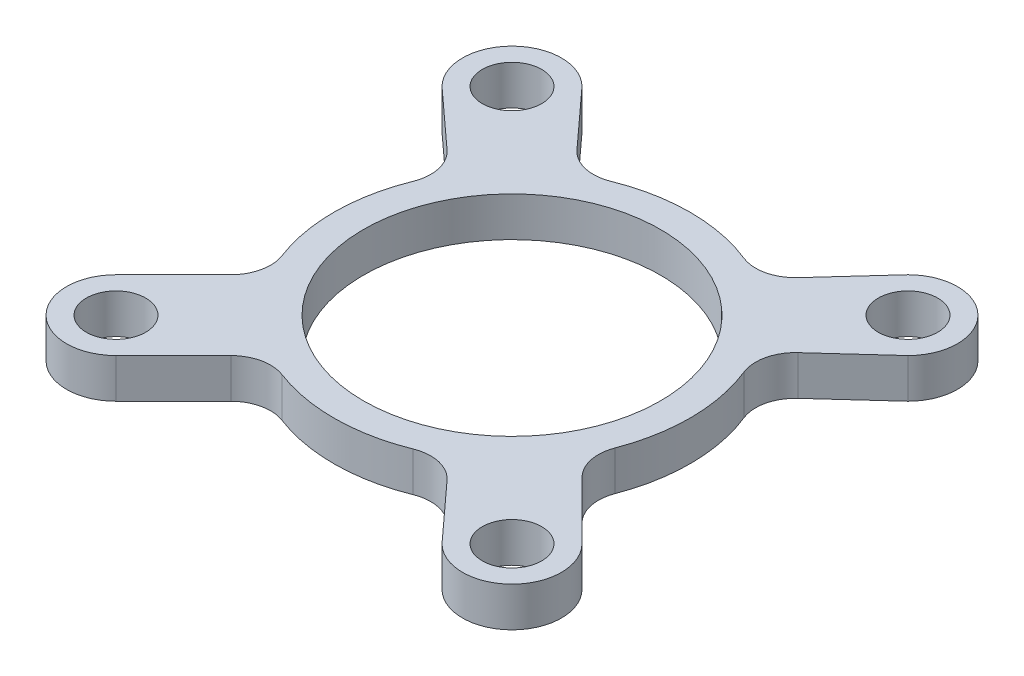
ISO-10303-21;
HEADER;
FILE_DESCRIPTION(('STEP AP214'),'2;1');
FILE_NAME('part.step','',(''),(''),'','','');
FILE_SCHEMA(('AUTOMOTIVE_DESIGN { 1 0 10303 214 1 1 1 1 }'));
ENDSEC;
DATA;
#1=APPLICATION_CONTEXT('core data for automotive mechanical design processes');
#2=APPLICATION_PROTOCOL_DEFINITION('international standard','automotive_design',2000,#1);
#3=PRODUCT_CONTEXT('',#1,'mechanical');
#4=PRODUCT('Part','Part','',(#3));
#5=PRODUCT_RELATED_PRODUCT_CATEGORY('part','',(#4));
#6=PRODUCT_DEFINITION_FORMATION('','',#4);
#7=PRODUCT_DEFINITION_CONTEXT('part definition',#1,'design');
#8=PRODUCT_DEFINITION('design','',#6,#7);
#9=PRODUCT_DEFINITION_SHAPE('','',#8);
#10=(LENGTH_UNIT() NAMED_UNIT(*) SI_UNIT(.MILLI.,.METRE.));
#11=(NAMED_UNIT(*) PLANE_ANGLE_UNIT() SI_UNIT($,.RADIAN.));
#12=(NAMED_UNIT(*) SI_UNIT($,.STERADIAN.) SOLID_ANGLE_UNIT());
#13=UNCERTAINTY_MEASURE_WITH_UNIT(LENGTH_MEASURE(1.E-05),#10,'distance_accuracy_value','');
#14=(GEOMETRIC_REPRESENTATION_CONTEXT(3) GLOBAL_UNCERTAINTY_ASSIGNED_CONTEXT((#13)) GLOBAL_UNIT_ASSIGNED_CONTEXT((#10,
#11,#12)) REPRESENTATION_CONTEXT('',''));
#15=CARTESIAN_POINT('',(0.,0.,0.));
#16=DIRECTION('',(0.,0.,1.));
#17=DIRECTION('',(1.,0.,0.));
#18=AXIS2_PLACEMENT_3D('',#15,#16,#17);
#19=CARTESIAN_POINT('',(-10.0000000000001,2.,10.));
#20=DIRECTION('',(0.,1.,0.));
#21=DIRECTION('',(0.,0.,1.));
#22=AXIS2_PLACEMENT_3D('',#19,#20,#21);
#23=PLANE('',#22);
#24=CARTESIAN_POINT('',(10.0000000000001,2.,-10.));
#25=DIRECTION('',(0.,1.,0.));
#26=DIRECTION('',(0.,0.,1.));
#27=AXIS2_PLACEMENT_3D('',#24,#25,#26);
#28=CIRCLE('',#27,1.5);
#29=CARTESIAN_POINT('',(10.0000000000001,2.,-8.5));
#30=VERTEX_POINT('',#29);
#31=EDGE_CURVE('E706',#30,#30,#28,.T.);
#32=ORIENTED_EDGE('',*,*,#31,.F.);
#33=EDGE_LOOP('',(#32));
#34=FACE_BOUND('',#33,.T.);
#35=CARTESIAN_POINT('',(-10.0000000000001,2.,10.));
#36=DIRECTION('',(0.,1.,0.));
#37=DIRECTION('',(0.,0.,1.));
#38=AXIS2_PLACEMENT_3D('',#35,#36,#37);
#39=CIRCLE('',#38,1.5);
#40=CARTESIAN_POINT('',(-10.0000000000001,2.,11.5));
#41=VERTEX_POINT('',#40);
#42=EDGE_CURVE('E694',#41,#41,#39,.T.);
#43=ORIENTED_EDGE('',*,*,#42,.F.);
#44=EDGE_LOOP('',(#43));
#45=FACE_BOUND('',#44,.T.);
#46=CARTESIAN_POINT('',(-10.0000000000001,2.,10.));
#47=DIRECTION('',(0.,1.,0.));
#48=DIRECTION('',(0.,0.,1.));
#49=AXIS2_PLACEMENT_3D('',#46,#47,#48);
#50=CIRCLE('',#49,2.50000000000001);
#51=CARTESIAN_POINT('',(-11.7677669529665,2.,8.23223304703362));
#52=VERTEX_POINT('',#51);
#53=CARTESIAN_POINT('',(-8.23223304703374,2.,11.7677669529664));
#54=VERTEX_POINT('',#53);
#55=EDGE_CURVE('E216',#52,#54,#50,.T.);
#56=ORIENTED_EDGE('',*,*,#55,.T.);
#57=DIRECTION('',(0.707106781186549,0.,-0.707106781186546));
#58=VECTOR('',#57,1.);
#59=CARTESIAN_POINT('',(-8.23223304703374,2.,11.7677669529664));
#60=LINE('',#59,#58);
#61=CARTESIAN_POINT('',(-5.32976783032287,2.,8.86530173625554));
#62=VERTEX_POINT('',#61);
#63=EDGE_CURVE('E205',#54,#62,#60,.T.);
#64=ORIENTED_EDGE('',*,*,#63,.T.);
#65=CARTESIAN_POINT('',(-3.91555426794978,2.,10.2795152986286));
#66=DIRECTION('',(0.,1.,0.));
#67=DIRECTION('',(0.,0.,1.));
#68=AXIS2_PLACEMENT_3D('',#65,#66,#67);
#69=CIRCLE('',#68,2.);
#70=CARTESIAN_POINT('',(-3.20363531014073,2.,8.41051251705979));
#71=VERTEX_POINT('',#70);
#72=EDGE_CURVE('E289',#62,#71,#69,.F.);
#73=ORIENTED_EDGE('',*,*,#72,.T.);
#74=CARTESIAN_POINT('',(0.,2.,0.));
#75=DIRECTION('',(0.,1.,0.));
#76=DIRECTION('',(0.,0.,1.));
#77=AXIS2_PLACEMENT_3D('',#74,#75,#76);
#78=CIRCLE('',#77,9.);
#79=CARTESIAN_POINT('',(3.35602438202188,2.,8.3508742265271));
#80=VERTEX_POINT('',#79);
#81=EDGE_CURVE('E215',#71,#80,#78,.T.);
#82=ORIENTED_EDGE('',*,*,#81,.T.);
#83=CARTESIAN_POINT('',(4.10180757802675,2.,10.2066240546442));
#84=DIRECTION('',(0.,1.,0.));
#85=DIRECTION('',(0.,0.,1.));
#86=AXIS2_PLACEMENT_3D('',#83,#84,#85);
#87=CIRCLE('',#86,2.);
#88=CARTESIAN_POINT('',(5.57959055754192,2.,8.85897518885788));
#89=VERTEX_POINT('',#88);
#90=EDGE_CURVE('E285',#80,#89,#87,.F.);
#91=ORIENTED_EDGE('',*,*,#90,.T.);
#92=DIRECTION('',(0.673824432893175,0.,0.73889148975759));
#93=VECTOR('',#92,1.);
#94=CARTESIAN_POINT('',(8.23223304703362,2.,11.7677669529665));
#95=LINE('',#94,#93);
#96=CARTESIAN_POINT('',(8.23223304703362,2.,11.7677669529665));
#97=VERTEX_POINT('',#96);
#98=EDGE_CURVE('E684',#89,#97,#95,.T.);
#99=ORIENTED_EDGE('',*,*,#98,.T.);
#100=CARTESIAN_POINT('',(10.,2.,10.0000000000001));
#101=DIRECTION('',(0.,1.,0.));
#102=DIRECTION('',(0.,0.,1.));
#103=AXIS2_PLACEMENT_3D('',#100,#101,#102);
#104=CIRCLE('',#103,2.5);
#105=CARTESIAN_POINT('',(11.7677669529664,2.,8.23223304703374));
#106=VERTEX_POINT('',#105);
#107=EDGE_CURVE('E412',#97,#106,#104,.T.);
#108=ORIENTED_EDGE('',*,*,#107,.T.);
#109=DIRECTION('',(-0.707106781186542,0.,-0.707106781186553));
#110=VECTOR('',#109,1.);
#111=CARTESIAN_POINT('',(11.7677669529664,2.,8.23223304703374));
#112=LINE('',#111,#110);
#113=CARTESIAN_POINT('',(8.86530173625554,2.,5.32976783032286));
#114=VERTEX_POINT('',#113);
#115=EDGE_CURVE('E391',#106,#114,#112,.T.);
#116=ORIENTED_EDGE('',*,*,#115,.T.);
#117=CARTESIAN_POINT('',(10.2795152986286,2.,3.91555426794978));
#118=DIRECTION('',(0.,1.,0.));
#119=DIRECTION('',(0.,0.,1.));
#120=AXIS2_PLACEMENT_3D('',#117,#118,#119);
#121=CIRCLE('',#120,2.);
#122=CARTESIAN_POINT('',(8.4105125170598,2.,3.20363531014073));
#123=VERTEX_POINT('',#122);
#124=EDGE_CURVE('E277',#114,#123,#121,.F.);
#125=ORIENTED_EDGE('',*,*,#124,.T.);
#126=CARTESIAN_POINT('',(0.,2.,0.));
#127=DIRECTION('',(0.,1.,0.));
#128=DIRECTION('',(0.,0.,1.));
#129=AXIS2_PLACEMENT_3D('',#126,#127,#128);
#130=CIRCLE('',#129,9.);
#131=CARTESIAN_POINT('',(8.3508742265271,2.,-3.35602438202188));
#132=VERTEX_POINT('',#131);
#133=EDGE_CURVE('E406',#123,#132,#130,.T.);
#134=ORIENTED_EDGE('',*,*,#133,.T.);
#135=CARTESIAN_POINT('',(10.2066240546442,2.,-4.10180757802675));
#136=DIRECTION('',(0.,1.,0.));
#137=DIRECTION('',(0.,0.,1.));
#138=AXIS2_PLACEMENT_3D('',#135,#136,#137);
#139=CIRCLE('',#138,2.);
#140=CARTESIAN_POINT('',(8.85897518885789,2.,-5.57959055754193));
#141=VERTEX_POINT('',#140);
#142=EDGE_CURVE('E281',#132,#141,#139,.F.);
#143=ORIENTED_EDGE('',*,*,#142,.T.);
#144=DIRECTION('',(0.738891489757591,0.,-0.673824432893175));
#145=VECTOR('',#144,1.);
#146=CARTESIAN_POINT('',(11.7677669529665,2.,-8.23223304703362));
#147=LINE('',#146,#145);
#148=CARTESIAN_POINT('',(11.7677669529665,2.,-8.23223304703363));
#149=VERTEX_POINT('',#148);
#150=EDGE_CURVE('E408',#141,#149,#147,.T.);
#151=ORIENTED_EDGE('',*,*,#150,.T.);
#152=CARTESIAN_POINT('',(10.0000000000001,2.,-10.));
#153=DIRECTION('',(0.,1.,0.));
#154=DIRECTION('',(0.,0.,-1.));
#155=AXIS2_PLACEMENT_3D('',#152,#153,#154);
#156=CIRCLE('',#155,2.5);
#157=CARTESIAN_POINT('',(8.23223304703374,2.,-11.7677669529664));
#158=VERTEX_POINT('',#157);
#159=EDGE_CURVE('E410',#149,#158,#156,.T.);
#160=ORIENTED_EDGE('',*,*,#159,.T.);
#161=DIRECTION('',(-0.673824432893177,0.,0.738891489757589));
#162=VECTOR('',#161,1.);
#163=CARTESIAN_POINT('',(8.23223304703374,2.,-11.7677669529664));
#164=LINE('',#163,#162);
#165=CARTESIAN_POINT('',(5.57959055754206,2.,-8.85897518885783));
#166=VERTEX_POINT('',#165);
#167=EDGE_CURVE('E329',#158,#166,#164,.T.);
#168=ORIENTED_EDGE('',*,*,#167,.T.);
#169=CARTESIAN_POINT('',(4.10180757802688,2.,-10.2066240546442));
#170=DIRECTION('',(0.,1.,0.));
#171=DIRECTION('',(0.,0.,1.));
#172=AXIS2_PLACEMENT_3D('',#169,#170,#171);
#173=CIRCLE('',#172,2.);
#174=CARTESIAN_POINT('',(3.35602438202199,2.,-8.35087422652706));
#175=VERTEX_POINT('',#174);
#176=EDGE_CURVE('E301',#166,#175,#173,.F.);
#177=ORIENTED_EDGE('',*,*,#176,.T.);
#178=CARTESIAN_POINT('',(0.,2.,0.));
#179=DIRECTION('',(0.,1.,0.));
#180=DIRECTION('',(0.,0.,1.));
#181=AXIS2_PLACEMENT_3D('',#178,#179,#180);
#182=CIRCLE('',#181,9.);
#183=CARTESIAN_POINT('',(-3.3560243820219,2.,-8.35087422652709));
#184=VERTEX_POINT('',#183);
#185=EDGE_CURVE('E325',#175,#184,#182,.T.);
#186=ORIENTED_EDGE('',*,*,#185,.T.);
#187=CARTESIAN_POINT('',(-4.10180757802676,2.,-10.2066240546442));
#188=DIRECTION('',(0.,1.,0.));
#189=DIRECTION('',(0.,0.,1.));
#190=AXIS2_PLACEMENT_3D('',#187,#188,#189);
#191=CIRCLE('',#190,2.);
#192=CARTESIAN_POINT('',(-5.57959055754195,2.,-8.85897518885788));
#193=VERTEX_POINT('',#192);
#194=EDGE_CURVE('E13',#184,#193,#191,.F.);
#195=ORIENTED_EDGE('',*,*,#194,.T.);
#196=DIRECTION('',(-0.673824432893173,0.,-0.738891489757592));
#197=VECTOR('',#196,1.);
#198=CARTESIAN_POINT('',(-8.23223304703363,2.,-11.7677669529665));
#199=LINE('',#198,#197);
#200=CARTESIAN_POINT('',(-8.23223304703362,2.,-11.7677669529665));
#201=VERTEX_POINT('',#200);
#202=EDGE_CURVE('E321',#193,#201,#199,.T.);
#203=ORIENTED_EDGE('',*,*,#202,.T.);
#204=CARTESIAN_POINT('',(-10.,2.,-10.0000000000001));
#205=DIRECTION('',(0.,1.,0.));
#206=DIRECTION('',(0.,0.,-1.));
#207=AXIS2_PLACEMENT_3D('',#204,#205,#206);
#208=CIRCLE('',#207,2.5);
#209=CARTESIAN_POINT('',(-11.7677669529664,2.,-8.23223304703374));
#210=VERTEX_POINT('',#209);
#211=EDGE_CURVE('E324',#201,#210,#208,.T.);
#212=ORIENTED_EDGE('',*,*,#211,.T.);
#213=DIRECTION('',(0.738891489757588,0.,0.673824432893177));
#214=VECTOR('',#213,1.);
#215=CARTESIAN_POINT('',(-11.7677669529664,2.,-8.23223304703374));
#216=LINE('',#215,#214);
#217=CARTESIAN_POINT('',(-8.85897518885783,2.,-5.57959055754206));
#218=VERTEX_POINT('',#217);
#219=EDGE_CURVE('E327',#210,#218,#216,.T.);
#220=ORIENTED_EDGE('',*,*,#219,.T.);
#221=CARTESIAN_POINT('',(-10.2066240546442,2.,-4.10180757802688));
#222=DIRECTION('',(0.,1.,0.));
#223=DIRECTION('',(0.,0.,1.));
#224=AXIS2_PLACEMENT_3D('',#221,#222,#223);
#225=CIRCLE('',#224,2.);
#226=CARTESIAN_POINT('',(-8.35087422652706,2.,-3.35602438202199));
#227=VERTEX_POINT('',#226);
#228=EDGE_CURVE('E297',#218,#227,#225,.F.);
#229=ORIENTED_EDGE('',*,*,#228,.T.);
#230=CARTESIAN_POINT('',(0.,2.,0.));
#231=DIRECTION('',(0.,1.,0.));
#232=DIRECTION('',(0.,0.,1.));
#233=AXIS2_PLACEMENT_3D('',#230,#231,#232);
#234=CIRCLE('',#233,9.);
#235=CARTESIAN_POINT('',(-8.41051251705983,2.,3.20363531014064));
#236=VERTEX_POINT('',#235);
#237=EDGE_CURVE('E335',#227,#236,#234,.T.);
#238=ORIENTED_EDGE('',*,*,#237,.T.);
#239=CARTESIAN_POINT('',(-10.2795152986287,2.,3.91555426794968));
#240=DIRECTION('',(0.,1.,0.));
#241=DIRECTION('',(0.,0.,1.));
#242=AXIS2_PLACEMENT_3D('',#239,#240,#241);
#243=CIRCLE('',#242,2.);
#244=CARTESIAN_POINT('',(-8.86530173625559,2.,5.32976783032278));
#245=VERTEX_POINT('',#244);
#246=EDGE_CURVE('E293',#236,#245,#243,.F.);
#247=ORIENTED_EDGE('',*,*,#246,.T.);
#248=DIRECTION('',(-0.707106781186551,0.,0.707106781186544));
#249=VECTOR('',#248,1.);
#250=CARTESIAN_POINT('',(-11.7677669529665,2.,8.23223304703362));
#251=LINE('',#250,#249);
#252=EDGE_CURVE('E221',#245,#52,#251,.T.);
#253=ORIENTED_EDGE('',*,*,#252,.T.);
#254=EDGE_LOOP('',(#56,#64,#73,#82,#91,#99,#108,#116,#125,#134,#143,#151,#160,#168,#177,#186,
#195,#203,#212,#220,#229,#238,#247,#253));
#255=FACE_BOUND('',#254,.T.);
#256=CARTESIAN_POINT('',(0.,2.,0.));
#257=DIRECTION('',(0.,1.,0.));
#258=DIRECTION('',(0.,0.,1.));
#259=AXIS2_PLACEMENT_3D('',#256,#257,#258);
#260=CIRCLE('',#259,7.5);
#261=CARTESIAN_POINT('',(0.,2.,7.5));
#262=VERTEX_POINT('',#261);
#263=EDGE_CURVE('E342',#262,#262,#260,.T.);
#264=ORIENTED_EDGE('',*,*,#263,.F.);
#265=EDGE_LOOP('',(#264));
#266=FACE_BOUND('',#265,.T.);
#267=CARTESIAN_POINT('',(10.,2.,10.0000000000001));
#268=DIRECTION('',(0.,1.,0.));
#269=DIRECTION('',(0.,0.,1.));
#270=AXIS2_PLACEMENT_3D('',#267,#268,#269);
#271=CIRCLE('',#270,1.5);
#272=CARTESIAN_POINT('',(10.,2.,11.5000000000001));
#273=VERTEX_POINT('',#272);
#274=EDGE_CURVE('E700',#273,#273,#271,.T.);
#275=ORIENTED_EDGE('',*,*,#274,.F.);
#276=EDGE_LOOP('',(#275));
#277=FACE_BOUND('',#276,.T.);
#278=CARTESIAN_POINT('',(-10.,2.,-10.0000000000001));
#279=DIRECTION('',(0.,1.,0.));
#280=DIRECTION('',(0.,0.,1.));
#281=AXIS2_PLACEMENT_3D('',#278,#279,#280);
#282=CIRCLE('',#281,1.5);
#283=CARTESIAN_POINT('',(-10.,2.,-8.5000000000001));
#284=VERTEX_POINT('',#283);
#285=EDGE_CURVE('E712',#284,#284,#282,.T.);
#286=ORIENTED_EDGE('',*,*,#285,.F.);
#287=EDGE_LOOP('',(#286));
#288=FACE_BOUND('',#287,.T.);
#289=ADVANCED_FACE('F45',(#34,#45,#255,#266,#277,#288),#23,.T.);
#290=CARTESIAN_POINT('',(-10.0000000000001,0.,10.));
#291=DIRECTION('',(0.,1.,0.));
#292=DIRECTION('',(0.,0.,1.));
#293=AXIS2_PLACEMENT_3D('',#290,#291,#292);
#294=PLANE('',#293);
#295=CARTESIAN_POINT('',(-10.0000000000001,0.,10.));
#296=DIRECTION('',(0.,1.,0.));
#297=DIRECTION('',(0.,0.,1.));
#298=AXIS2_PLACEMENT_3D('',#295,#296,#297);
#299=CIRCLE('',#298,2.50000000000001);
#300=CARTESIAN_POINT('',(-11.7677669529665,0.,8.23223304703362));
#301=VERTEX_POINT('',#300);
#302=CARTESIAN_POINT('',(-8.23223304703374,0.,11.7677669529664));
#303=VERTEX_POINT('',#302);
#304=EDGE_CURVE('E229',#301,#303,#299,.T.);
#305=ORIENTED_EDGE('',*,*,#304,.F.);
#306=DIRECTION('',(-0.707106781186551,0.,0.707106781186544));
#307=VECTOR('',#306,1.);
#308=CARTESIAN_POINT('',(-11.7677669529665,0.,8.23223304703362));
#309=LINE('',#308,#307);
#310=CARTESIAN_POINT('',(-8.86530173625559,0.,5.32976783032278));
#311=VERTEX_POINT('',#310);
#312=EDGE_CURVE('E225',#311,#301,#309,.T.);
#313=ORIENTED_EDGE('',*,*,#312,.F.);
#314=CARTESIAN_POINT('',(-10.2795152986287,0.,3.91555426794968));
#315=DIRECTION('',(0.,1.,0.));
#316=DIRECTION('',(0.,0.,1.));
#317=AXIS2_PLACEMENT_3D('',#314,#315,#316);
#318=CIRCLE('',#317,2.);
#319=CARTESIAN_POINT('',(-8.41051251705983,0.,3.20363531014064));
#320=VERTEX_POINT('',#319);
#321=EDGE_CURVE('E291',#311,#320,#318,.T.);
#322=ORIENTED_EDGE('',*,*,#321,.T.);
#323=CARTESIAN_POINT('',(0.,0.,0.));
#324=DIRECTION('',(0.,1.,0.));
#325=DIRECTION('',(0.,0.,1.));
#326=AXIS2_PLACEMENT_3D('',#323,#324,#325);
#327=CIRCLE('',#326,9.);
#328=CARTESIAN_POINT('',(-8.35087422652706,0.,-3.35602438202199));
#329=VERTEX_POINT('',#328);
#330=EDGE_CURVE('E369',#329,#320,#327,.T.);
#331=ORIENTED_EDGE('',*,*,#330,.F.);
#332=CARTESIAN_POINT('',(-10.2066240546442,0.,-4.10180757802688));
#333=DIRECTION('',(0.,1.,0.));
#334=DIRECTION('',(0.,0.,1.));
#335=AXIS2_PLACEMENT_3D('',#332,#333,#334);
#336=CIRCLE('',#335,2.);
#337=CARTESIAN_POINT('',(-8.85897518885783,0.,-5.57959055754206));
#338=VERTEX_POINT('',#337);
#339=EDGE_CURVE('E295',#329,#338,#336,.T.);
#340=ORIENTED_EDGE('',*,*,#339,.T.);
#341=DIRECTION('',(0.738891489757588,0.,0.673824432893177));
#342=VECTOR('',#341,1.);
#343=CARTESIAN_POINT('',(-11.7677669529664,0.,-8.23223304703374));
#344=LINE('',#343,#342);
#345=CARTESIAN_POINT('',(-11.7677669529664,0.,-8.23223304703374));
#346=VERTEX_POINT('',#345);
#347=EDGE_CURVE('E366',#346,#338,#344,.T.);
#348=ORIENTED_EDGE('',*,*,#347,.F.);
#349=CARTESIAN_POINT('',(-10.,0.,-10.0000000000001));
#350=DIRECTION('',(0.,1.,0.));
#351=DIRECTION('',(0.,0.,-1.));
#352=AXIS2_PLACEMENT_3D('',#349,#350,#351);
#353=CIRCLE('',#352,2.5);
#354=CARTESIAN_POINT('',(-8.23223304703362,0.,-11.7677669529665));
#355=VERTEX_POINT('',#354);
#356=EDGE_CURVE('E364',#355,#346,#353,.T.);
#357=ORIENTED_EDGE('',*,*,#356,.F.);
#358=DIRECTION('',(-0.673824432893173,0.,-0.738891489757592));
#359=VECTOR('',#358,1.);
#360=CARTESIAN_POINT('',(-8.23223304703363,0.,-11.7677669529665));
#361=LINE('',#360,#359);
#362=CARTESIAN_POINT('',(-5.57959055754195,0.,-8.85897518885788));
#363=VERTEX_POINT('',#362);
#364=EDGE_CURVE('E310',#363,#355,#361,.T.);
#365=ORIENTED_EDGE('',*,*,#364,.F.);
#366=CARTESIAN_POINT('',(-4.10180757802676,0.,-10.2066240546442));
#367=DIRECTION('',(0.,1.,0.));
#368=DIRECTION('',(0.,0.,1.));
#369=AXIS2_PLACEMENT_3D('',#366,#367,#368);
#370=CIRCLE('',#369,2.);
#371=CARTESIAN_POINT('',(-3.3560243820219,0.,-8.35087422652709));
#372=VERTEX_POINT('',#371);
#373=EDGE_CURVE('E53',#363,#372,#370,.T.);
#374=ORIENTED_EDGE('',*,*,#373,.T.);
#375=CARTESIAN_POINT('',(0.,0.,0.));
#376=DIRECTION('',(0.,1.,0.));
#377=DIRECTION('',(0.,0.,1.));
#378=AXIS2_PLACEMENT_3D('',#375,#376,#377);
#379=CIRCLE('',#378,9.);
#380=CARTESIAN_POINT('',(3.35602438202199,0.,-8.35087422652706));
#381=VERTEX_POINT('',#380);
#382=EDGE_CURVE('E308',#381,#372,#379,.T.);
#383=ORIENTED_EDGE('',*,*,#382,.F.);
#384=CARTESIAN_POINT('',(4.10180757802688,0.,-10.2066240546442));
#385=DIRECTION('',(0.,1.,0.));
#386=DIRECTION('',(0.,0.,1.));
#387=AXIS2_PLACEMENT_3D('',#384,#385,#386);
#388=CIRCLE('',#387,2.);
#389=CARTESIAN_POINT('',(5.57959055754206,0.,-8.85897518885783));
#390=VERTEX_POINT('',#389);
#391=EDGE_CURVE('E299',#381,#390,#388,.T.);
#392=ORIENTED_EDGE('',*,*,#391,.T.);
#393=DIRECTION('',(-0.673824432893177,0.,0.738891489757589));
#394=VECTOR('',#393,1.);
#395=CARTESIAN_POINT('',(8.23223304703374,0.,-11.7677669529664));
#396=LINE('',#395,#394);
#397=CARTESIAN_POINT('',(8.23223304703374,0.,-11.7677669529664));
#398=VERTEX_POINT('',#397);
#399=EDGE_CURVE('E315',#398,#390,#396,.T.);
#400=ORIENTED_EDGE('',*,*,#399,.F.);
#401=CARTESIAN_POINT('',(10.0000000000001,0.,-10.));
#402=DIRECTION('',(0.,1.,0.));
#403=DIRECTION('',(0.,0.,-1.));
#404=AXIS2_PLACEMENT_3D('',#401,#402,#403);
#405=CIRCLE('',#404,2.5);
#406=CARTESIAN_POINT('',(11.7677669529665,0.,-8.23223304703363));
#407=VERTEX_POINT('',#406);
#408=EDGE_CURVE('E359',#407,#398,#405,.T.);
#409=ORIENTED_EDGE('',*,*,#408,.F.);
#410=DIRECTION('',(0.738891489757591,0.,-0.673824432893175));
#411=VECTOR('',#410,1.);
#412=CARTESIAN_POINT('',(11.7677669529665,0.,-8.23223304703362));
#413=LINE('',#412,#411);
#414=CARTESIAN_POINT('',(8.85897518885789,0.,-5.57959055754193));
#415=VERTEX_POINT('',#414);
#416=EDGE_CURVE('E357',#415,#407,#413,.T.);
#417=ORIENTED_EDGE('',*,*,#416,.F.);
#418=CARTESIAN_POINT('',(10.2066240546442,0.,-4.10180757802675));
#419=DIRECTION('',(0.,1.,0.));
#420=DIRECTION('',(0.,0.,1.));
#421=AXIS2_PLACEMENT_3D('',#418,#419,#420);
#422=CIRCLE('',#421,2.);
#423=CARTESIAN_POINT('',(8.3508742265271,0.,-3.35602438202188));
#424=VERTEX_POINT('',#423);
#425=EDGE_CURVE('E279',#415,#424,#422,.T.);
#426=ORIENTED_EDGE('',*,*,#425,.T.);
#427=CARTESIAN_POINT('',(0.,0.,0.));
#428=DIRECTION('',(0.,1.,0.));
#429=DIRECTION('',(0.,0.,1.));
#430=AXIS2_PLACEMENT_3D('',#427,#428,#429);
#431=CIRCLE('',#430,9.);
#432=CARTESIAN_POINT('',(8.4105125170598,0.,3.20363531014073));
#433=VERTEX_POINT('',#432);
#434=EDGE_CURVE('E354',#433,#424,#431,.T.);
#435=ORIENTED_EDGE('',*,*,#434,.F.);
#436=CARTESIAN_POINT('',(10.2795152986286,0.,3.91555426794978));
#437=DIRECTION('',(0.,1.,0.));
#438=DIRECTION('',(0.,0.,1.));
#439=AXIS2_PLACEMENT_3D('',#436,#437,#438);
#440=CIRCLE('',#439,2.);
#441=CARTESIAN_POINT('',(8.86530173625554,0.,5.32976783032286));
#442=VERTEX_POINT('',#441);
#443=EDGE_CURVE('E275',#433,#442,#440,.T.);
#444=ORIENTED_EDGE('',*,*,#443,.T.);
#445=DIRECTION('',(-0.707106781186542,0.,-0.707106781186553));
#446=VECTOR('',#445,1.);
#447=CARTESIAN_POINT('',(11.7677669529664,0.,8.23223304703374));
#448=LINE('',#447,#446);
#449=CARTESIAN_POINT('',(11.7677669529664,0.,8.23223304703374));
#450=VERTEX_POINT('',#449);
#451=EDGE_CURVE('E351',#450,#442,#448,.T.);
#452=ORIENTED_EDGE('',*,*,#451,.F.);
#453=CARTESIAN_POINT('',(10.,0.,10.0000000000001));
#454=DIRECTION('',(0.,1.,0.));
#455=DIRECTION('',(0.,0.,1.));
#456=AXIS2_PLACEMENT_3D('',#453,#454,#455);
#457=CIRCLE('',#456,2.5);
#458=CARTESIAN_POINT('',(8.23223304703362,0.,11.7677669529665));
#459=VERTEX_POINT('',#458);
#460=EDGE_CURVE('E349',#459,#450,#457,.T.);
#461=ORIENTED_EDGE('',*,*,#460,.F.);
#462=DIRECTION('',(0.673824432893175,0.,0.73889148975759));
#463=VECTOR('',#462,1.);
#464=CARTESIAN_POINT('',(8.23223304703362,0.,11.7677669529665));
#465=LINE('',#464,#463);
#466=CARTESIAN_POINT('',(5.57959055754192,0.,8.85897518885788));
#467=VERTEX_POINT('',#466);
#468=EDGE_CURVE('E347',#467,#459,#465,.T.);
#469=ORIENTED_EDGE('',*,*,#468,.F.);
#470=CARTESIAN_POINT('',(4.10180757802675,0.,10.2066240546442));
#471=DIRECTION('',(0.,1.,0.));
#472=DIRECTION('',(0.,0.,1.));
#473=AXIS2_PLACEMENT_3D('',#470,#471,#472);
#474=CIRCLE('',#473,2.);
#475=CARTESIAN_POINT('',(3.35602438202188,0.,8.3508742265271));
#476=VERTEX_POINT('',#475);
#477=EDGE_CURVE('E283',#467,#476,#474,.T.);
#478=ORIENTED_EDGE('',*,*,#477,.T.);
#479=CARTESIAN_POINT('',(0.,0.,0.));
#480=DIRECTION('',(0.,1.,0.));
#481=DIRECTION('',(0.,0.,1.));
#482=AXIS2_PLACEMENT_3D('',#479,#480,#481);
#483=CIRCLE('',#482,9.);
#484=CARTESIAN_POINT('',(-3.20363531014073,0.,8.41051251705979));
#485=VERTEX_POINT('',#484);
#486=EDGE_CURVE('E344',#485,#476,#483,.T.);
#487=ORIENTED_EDGE('',*,*,#486,.F.);
#488=CARTESIAN_POINT('',(-3.91555426794978,0.,10.2795152986286));
#489=DIRECTION('',(0.,1.,0.));
#490=DIRECTION('',(0.,0.,1.));
#491=AXIS2_PLACEMENT_3D('',#488,#489,#490);
#492=CIRCLE('',#491,2.);
#493=CARTESIAN_POINT('',(-5.32976783032287,0.,8.86530173625554));
#494=VERTEX_POINT('',#493);
#495=EDGE_CURVE('E287',#485,#494,#492,.T.);
#496=ORIENTED_EDGE('',*,*,#495,.T.);
#497=DIRECTION('',(0.707106781186549,0.,-0.707106781186546));
#498=VECTOR('',#497,1.);
#499=CARTESIAN_POINT('',(-8.23223304703374,0.,11.7677669529664));
#500=LINE('',#499,#498);
#501=EDGE_CURVE('E341',#303,#494,#500,.T.);
#502=ORIENTED_EDGE('',*,*,#501,.F.);
#503=EDGE_LOOP('',(#305,#313,#322,#331,#340,#348,#357,#365,#374,#383,#392,#400,#409,#417,#426,
#435,#444,#452,#461,#469,#478,#487,#496,#502));
#504=FACE_BOUND('',#503,.T.);
#505=CARTESIAN_POINT('',(0.,0.,0.));
#506=DIRECTION('',(0.,1.,0.));
#507=DIRECTION('',(0.,0.,1.));
#508=AXIS2_PLACEMENT_3D('',#505,#506,#507);
#509=CIRCLE('',#508,7.5);
#510=CARTESIAN_POINT('',(0.,0.,7.5));
#511=VERTEX_POINT('',#510);
#512=EDGE_CURVE('E691',#511,#511,#509,.T.);
#513=ORIENTED_EDGE('',*,*,#512,.T.);
#514=EDGE_LOOP('',(#513));
#515=FACE_BOUND('',#514,.T.);
#516=CARTESIAN_POINT('',(-10.0000000000001,0.,10.));
#517=DIRECTION('',(0.,1.,0.));
#518=DIRECTION('',(0.,0.,1.));
#519=AXIS2_PLACEMENT_3D('',#516,#517,#518);
#520=CIRCLE('',#519,1.5);
#521=CARTESIAN_POINT('',(-10.0000000000001,0.,11.5));
#522=VERTEX_POINT('',#521);
#523=EDGE_CURVE('E697',#522,#522,#520,.T.);
#524=ORIENTED_EDGE('',*,*,#523,.T.);
#525=EDGE_LOOP('',(#524));
#526=FACE_BOUND('',#525,.T.);
#527=CARTESIAN_POINT('',(10.,0.,10.0000000000001));
#528=DIRECTION('',(0.,1.,0.));
#529=DIRECTION('',(0.,0.,1.));
#530=AXIS2_PLACEMENT_3D('',#527,#528,#529);
#531=CIRCLE('',#530,1.5);
#532=CARTESIAN_POINT('',(10.,0.,11.5000000000001));
#533=VERTEX_POINT('',#532);
#534=EDGE_CURVE('E703',#533,#533,#531,.T.);
#535=ORIENTED_EDGE('',*,*,#534,.T.);
#536=EDGE_LOOP('',(#535));
#537=FACE_BOUND('',#536,.T.);
#538=CARTESIAN_POINT('',(10.0000000000001,0.,-10.));
#539=DIRECTION('',(0.,1.,0.));
#540=DIRECTION('',(0.,0.,1.));
#541=AXIS2_PLACEMENT_3D('',#538,#539,#540);
#542=CIRCLE('',#541,1.5);
#543=CARTESIAN_POINT('',(10.0000000000001,0.,-8.5));
#544=VERTEX_POINT('',#543);
#545=EDGE_CURVE('E709',#544,#544,#542,.T.);
#546=ORIENTED_EDGE('',*,*,#545,.T.);
#547=EDGE_LOOP('',(#546));
#548=FACE_BOUND('',#547,.T.);
#549=CARTESIAN_POINT('',(-10.,0.,-10.0000000000001));
#550=DIRECTION('',(0.,1.,0.));
#551=DIRECTION('',(0.,0.,1.));
#552=AXIS2_PLACEMENT_3D('',#549,#550,#551);
#553=CIRCLE('',#552,1.5);
#554=CARTESIAN_POINT('',(-10.,0.,-8.5000000000001));
#555=VERTEX_POINT('',#554);
#556=EDGE_CURVE('E715',#555,#555,#553,.T.);
#557=ORIENTED_EDGE('',*,*,#556,.T.);
#558=EDGE_LOOP('',(#557));
#559=FACE_BOUND('',#558,.T.);
#560=ADVANCED_FACE('F306',(#504,#515,#526,#537,#548,#559),#294,.F.);
#561=CARTESIAN_POINT('',(-10.0000000000001,2.,10.));
#562=DIRECTION('',(0.,-1.,0.));
#563=DIRECTION('',(0.,0.,-1.));
#564=AXIS2_PLACEMENT_3D('',#561,#562,#563);
#565=CYLINDRICAL_SURFACE('',#564,2.50000000000001);
#566=ORIENTED_EDGE('',*,*,#304,.T.);
#567=DIRECTION('',(0.,-1.,0.));
#568=VECTOR('',#567,1.);
#569=CARTESIAN_POINT('',(-8.23223304703374,2.,11.7677669529664));
#570=LINE('',#569,#568);
#571=EDGE_CURVE('E210',#54,#303,#570,.T.);
#572=ORIENTED_EDGE('',*,*,#571,.F.);
#573=ORIENTED_EDGE('',*,*,#55,.F.);
#574=DIRECTION('',(0.,-1.,0.));
#575=VECTOR('',#574,1.);
#576=CARTESIAN_POINT('',(-11.7677669529665,2.,8.23223304703362));
#577=LINE('',#576,#575);
#578=EDGE_CURVE('E339',#52,#301,#577,.T.);
#579=ORIENTED_EDGE('',*,*,#578,.T.);
#580=EDGE_LOOP('',(#566,#572,#573,#579));
#581=FACE_BOUND('',#580,.T.);
#582=ADVANCED_FACE('F227',(#581),#565,.T.);
#583=CARTESIAN_POINT('',(-8.23223304703374,2.,11.7677669529664));
#584=DIRECTION('',(-0.707106781186546,0.,-0.707106781186549));
#585=DIRECTION('',(-0.707106781186549,0.,0.707106781186546));
#586=AXIS2_PLACEMENT_3D('',#583,#584,#585);
#587=PLANE('',#586);
#588=ORIENTED_EDGE('',*,*,#501,.T.);
#589=DIRECTION('',(0.,1.,0.));
#590=VECTOR('',#589,1.);
#591=CARTESIAN_POINT('',(-5.32976783032287,2.,8.86530173625554));
#592=LINE('',#591,#590);
#593=EDGE_CURVE('E213',#494,#62,#592,.T.);
#594=ORIENTED_EDGE('',*,*,#593,.T.);
#595=ORIENTED_EDGE('',*,*,#63,.F.);
#596=ORIENTED_EDGE('',*,*,#571,.T.);
#597=EDGE_LOOP('',(#588,#594,#595,#596));
#598=FACE_BOUND('',#597,.T.);
#599=ADVANCED_FACE('F208',(#598),#587,.F.);
#600=CARTESIAN_POINT('',(0.,2.,0.));
#601=DIRECTION('',(0.,-1.,0.));
#602=DIRECTION('',(0.,0.,-1.));
#603=AXIS2_PLACEMENT_3D('',#600,#601,#602);
#604=CYLINDRICAL_SURFACE('',#603,9.);
#605=ORIENTED_EDGE('',*,*,#486,.T.);
#606=DIRECTION('',(0.,-1.,0.));
#607=VECTOR('',#606,1.);
#608=CARTESIAN_POINT('',(3.35602438202188,2.,8.3508742265271));
#609=LINE('',#608,#607);
#610=EDGE_CURVE('E253',#476,#80,#609,.F.);
#611=ORIENTED_EDGE('',*,*,#610,.T.);
#612=ORIENTED_EDGE('',*,*,#81,.F.);
#613=DIRECTION('',(0.,-1.,0.));
#614=VECTOR('',#613,1.);
#615=CARTESIAN_POINT('',(-3.20363531014073,2.,8.41051251705979));
#616=LINE('',#615,#614);
#617=EDGE_CURVE('E250',#71,#485,#616,.T.);
#618=ORIENTED_EDGE('',*,*,#617,.T.);
#619=EDGE_LOOP('',(#605,#611,#612,#618));
#620=FACE_BOUND('',#619,.T.);
#621=ADVANCED_FACE('F499',(#620),#604,.T.);
#622=CARTESIAN_POINT('',(8.23223304703362,2.,11.7677669529665));
#623=DIRECTION('',(0.73889148975759,0.,-0.673824432893175));
#624=DIRECTION('',(-0.673824432893175,0.,-0.73889148975759));
#625=AXIS2_PLACEMENT_3D('',#622,#623,#624);
#626=PLANE('',#625);
#627=ORIENTED_EDGE('',*,*,#98,.F.);
#628=DIRECTION('',(0.,1.,0.));
#629=VECTOR('',#628,1.);
#630=CARTESIAN_POINT('',(5.57959055754193,0.,8.85897518885788));
#631=LINE('',#630,#629);
#632=EDGE_CURVE('E247',#89,#467,#631,.F.);
#633=ORIENTED_EDGE('',*,*,#632,.T.);
#634=ORIENTED_EDGE('',*,*,#468,.T.);
#635=DIRECTION('',(0.,-1.,0.));
#636=VECTOR('',#635,1.);
#637=CARTESIAN_POINT('',(8.23223304703362,2.,11.7677669529665));
#638=LINE('',#637,#636);
#639=EDGE_CURVE('E231',#97,#459,#638,.T.);
#640=ORIENTED_EDGE('',*,*,#639,.F.);
#641=EDGE_LOOP('',(#627,#633,#634,#640));
#642=FACE_BOUND('',#641,.T.);
#643=ADVANCED_FACE('F496',(#642),#626,.F.);
#644=CARTESIAN_POINT('',(10.,2.,10.0000000000001));
#645=DIRECTION('',(0.,-1.,0.));
#646=DIRECTION('',(0.,0.,-1.));
#647=AXIS2_PLACEMENT_3D('',#644,#645,#646);
#648=CYLINDRICAL_SURFACE('',#647,2.5);
#649=ORIENTED_EDGE('',*,*,#460,.T.);
#650=DIRECTION('',(0.,-1.,0.));
#651=VECTOR('',#650,1.);
#652=CARTESIAN_POINT('',(11.7677669529664,2.,8.23223304703374));
#653=LINE('',#652,#651);
#654=EDGE_CURVE('E236',#106,#450,#653,.T.);
#655=ORIENTED_EDGE('',*,*,#654,.F.);
#656=ORIENTED_EDGE('',*,*,#107,.F.);
#657=ORIENTED_EDGE('',*,*,#639,.T.);
#658=EDGE_LOOP('',(#649,#655,#656,#657));
#659=FACE_BOUND('',#658,.T.);
#660=ADVANCED_FACE('F493',(#659),#648,.T.);
#661=CARTESIAN_POINT('',(11.7677669529664,2.,8.23223304703374));
#662=DIRECTION('',(-0.707106781186553,0.,0.707106781186542));
#663=DIRECTION('',(0.707106781186542,0.,0.707106781186553));
#664=AXIS2_PLACEMENT_3D('',#661,#662,#663);
#665=PLANE('',#664);
#666=ORIENTED_EDGE('',*,*,#451,.T.);
#667=DIRECTION('',(0.,1.,0.));
#668=VECTOR('',#667,1.);
#669=CARTESIAN_POINT('',(8.86530173625554,2.,5.32976783032286));
#670=LINE('',#669,#668);
#671=EDGE_CURVE('E242',#442,#114,#670,.T.);
#672=ORIENTED_EDGE('',*,*,#671,.T.);
#673=ORIENTED_EDGE('',*,*,#115,.F.);
#674=ORIENTED_EDGE('',*,*,#654,.T.);
#675=EDGE_LOOP('',(#666,#672,#673,#674));
#676=FACE_BOUND('',#675,.T.);
#677=ADVANCED_FACE('F388',(#676),#665,.F.);
#678=CARTESIAN_POINT('',(0.,2.,0.));
#679=DIRECTION('',(0.,-1.,0.));
#680=DIRECTION('',(0.,0.,-1.));
#681=AXIS2_PLACEMENT_3D('',#678,#679,#680);
#682=CYLINDRICAL_SURFACE('',#681,9.);
#683=ORIENTED_EDGE('',*,*,#133,.F.);
#684=DIRECTION('',(0.,-1.,0.));
#685=VECTOR('',#684,1.);
#686=CARTESIAN_POINT('',(8.4105125170598,2.,3.20363531014073));
#687=LINE('',#686,#685);
#688=EDGE_CURVE('E233',#123,#433,#687,.T.);
#689=ORIENTED_EDGE('',*,*,#688,.T.);
#690=ORIENTED_EDGE('',*,*,#434,.T.);
#691=DIRECTION('',(0.,-1.,0.));
#692=VECTOR('',#691,1.);
#693=CARTESIAN_POINT('',(8.3508742265271,2.,-3.35602438202188));
#694=LINE('',#693,#692);
#695=EDGE_CURVE('E230',#424,#132,#694,.F.);
#696=ORIENTED_EDGE('',*,*,#695,.T.);
#697=EDGE_LOOP('',(#683,#689,#690,#696));
#698=FACE_BOUND('',#697,.T.);
#699=ADVANCED_FACE('F403',(#698),#682,.T.);
#700=CARTESIAN_POINT('',(11.7677669529665,2.,-8.23223304703362));
#701=DIRECTION('',(-0.673824432893175,0.,-0.738891489757591));
#702=DIRECTION('',(-0.738891489757591,0.,0.673824432893175));
#703=AXIS2_PLACEMENT_3D('',#700,#701,#702);
#704=PLANE('',#703);
#705=ORIENTED_EDGE('',*,*,#150,.F.);
#706=DIRECTION('',(0.,1.,0.));
#707=VECTOR('',#706,1.);
#708=CARTESIAN_POINT('',(8.85897518885789,0.,-5.57959055754193));
#709=LINE('',#708,#707);
#710=EDGE_CURVE('E244',#141,#415,#709,.F.);
#711=ORIENTED_EDGE('',*,*,#710,.T.);
#712=ORIENTED_EDGE('',*,*,#416,.T.);
#713=DIRECTION('',(0.,-1.,0.));
#714=VECTOR('',#713,1.);
#715=CARTESIAN_POINT('',(11.7677669529665,2.,-8.23223304703363));
#716=LINE('',#715,#714);
#717=EDGE_CURVE('E381',#149,#407,#716,.T.);
#718=ORIENTED_EDGE('',*,*,#717,.F.);
#719=EDGE_LOOP('',(#705,#711,#712,#718));
#720=FACE_BOUND('',#719,.T.);
#721=ADVANCED_FACE('F434',(#720),#704,.F.);
#722=CARTESIAN_POINT('',(10.0000000000001,2.,-10.));
#723=DIRECTION('',(0.,-1.,0.));
#724=DIRECTION('',(0.,0.,-1.));
#725=AXIS2_PLACEMENT_3D('',#722,#723,#724);
#726=CYLINDRICAL_SURFACE('',#725,2.5);
#727=ORIENTED_EDGE('',*,*,#408,.T.);
#728=DIRECTION('',(0.,-1.,0.));
#729=VECTOR('',#728,1.);
#730=CARTESIAN_POINT('',(8.23223304703374,2.,-11.7677669529664));
#731=LINE('',#730,#729);
#732=EDGE_CURVE('E378',#158,#398,#731,.T.);
#733=ORIENTED_EDGE('',*,*,#732,.F.);
#734=ORIENTED_EDGE('',*,*,#159,.F.);
#735=ORIENTED_EDGE('',*,*,#717,.T.);
#736=EDGE_LOOP('',(#727,#733,#734,#735));
#737=FACE_BOUND('',#736,.T.);
#738=ADVANCED_FACE('F429',(#737),#726,.T.);
#739=CARTESIAN_POINT('',(8.23223304703374,2.,-11.7677669529664));
#740=DIRECTION('',(0.738891489757589,0.,0.673824432893177));
#741=DIRECTION('',(0.673824432893177,0.,-0.738891489757589));
#742=AXIS2_PLACEMENT_3D('',#739,#740,#741);
#743=PLANE('',#742);
#744=ORIENTED_EDGE('',*,*,#399,.T.);
#745=DIRECTION('',(0.,1.,0.));
#746=VECTOR('',#745,1.);
#747=CARTESIAN_POINT('',(5.57959055754206,2.,-8.85897518885783));
#748=LINE('',#747,#746);
#749=EDGE_CURVE('E271',#390,#166,#748,.T.);
#750=ORIENTED_EDGE('',*,*,#749,.T.);
#751=ORIENTED_EDGE('',*,*,#167,.F.);
#752=ORIENTED_EDGE('',*,*,#732,.T.);
#753=EDGE_LOOP('',(#744,#750,#751,#752));
#754=FACE_BOUND('',#753,.T.);
#755=ADVANCED_FACE('F427',(#754),#743,.F.);
#756=CARTESIAN_POINT('',(0.,2.,0.));
#757=DIRECTION('',(0.,-1.,0.));
#758=DIRECTION('',(0.,0.,-1.));
#759=AXIS2_PLACEMENT_3D('',#756,#757,#758);
#760=CYLINDRICAL_SURFACE('',#759,9.);
#761=ORIENTED_EDGE('',*,*,#185,.F.);
#762=DIRECTION('',(0.,-1.,0.));
#763=VECTOR('',#762,1.);
#764=CARTESIAN_POINT('',(3.356024382022,2.,-8.35087422652706));
#765=LINE('',#764,#763);
#766=EDGE_CURVE('E268',#175,#381,#765,.T.);
#767=ORIENTED_EDGE('',*,*,#766,.T.);
#768=ORIENTED_EDGE('',*,*,#382,.T.);
#769=DIRECTION('',(0.,-1.,0.));
#770=VECTOR('',#769,1.);
#771=CARTESIAN_POINT('',(-3.3560243820219,2.,-8.3508742265271));
#772=LINE('',#771,#770);
#773=EDGE_CURVE('E266',#372,#184,#772,.F.);
#774=ORIENTED_EDGE('',*,*,#773,.T.);
#775=EDGE_LOOP('',(#761,#767,#768,#774));
#776=FACE_BOUND('',#775,.T.);
#777=ADVANCED_FACE('F313',(#776),#760,.T.);
#778=CARTESIAN_POINT('',(-8.23223304703363,2.,-11.7677669529665));
#779=DIRECTION('',(-0.738891489757592,0.,0.673824432893173));
#780=DIRECTION('',(0.673824432893173,0.,0.738891489757592));
#781=AXIS2_PLACEMENT_3D('',#778,#779,#780);
#782=PLANE('',#781);
#783=ORIENTED_EDGE('',*,*,#202,.F.);
#784=DIRECTION('',(0.,1.,0.));
#785=VECTOR('',#784,1.);
#786=CARTESIAN_POINT('',(-5.57959055754195,0.,-8.85897518885788));
#787=LINE('',#786,#785);
#788=EDGE_CURVE('E273',#193,#363,#787,.F.);
#789=ORIENTED_EDGE('',*,*,#788,.T.);
#790=ORIENTED_EDGE('',*,*,#364,.T.);
#791=DIRECTION('',(0.,-1.,0.));
#792=VECTOR('',#791,1.);
#793=CARTESIAN_POINT('',(-8.23223304703362,2.,-11.7677669529665));
#794=LINE('',#793,#792);
#795=EDGE_CURVE('E322',#201,#355,#794,.T.);
#796=ORIENTED_EDGE('',*,*,#795,.F.);
#797=EDGE_LOOP('',(#783,#789,#790,#796));
#798=FACE_BOUND('',#797,.T.);
#799=ADVANCED_FACE('F318',(#798),#782,.F.);
#800=CARTESIAN_POINT('',(-10.,2.,-10.0000000000001));
#801=DIRECTION('',(0.,-1.,0.));
#802=DIRECTION('',(0.,0.,-1.));
#803=AXIS2_PLACEMENT_3D('',#800,#801,#802);
#804=CYLINDRICAL_SURFACE('',#803,2.5);
#805=ORIENTED_EDGE('',*,*,#356,.T.);
#806=DIRECTION('',(0.,-1.,0.));
#807=VECTOR('',#806,1.);
#808=CARTESIAN_POINT('',(-11.7677669529664,2.,-8.23223304703374));
#809=LINE('',#808,#807);
#810=EDGE_CURVE('E374',#210,#346,#809,.T.);
#811=ORIENTED_EDGE('',*,*,#810,.F.);
#812=ORIENTED_EDGE('',*,*,#211,.F.);
#813=ORIENTED_EDGE('',*,*,#795,.T.);
#814=EDGE_LOOP('',(#805,#811,#812,#813));
#815=FACE_BOUND('',#814,.T.);
#816=ADVANCED_FACE('F474',(#815),#804,.T.);
#817=CARTESIAN_POINT('',(-11.7677669529664,2.,-8.23223304703374));
#818=DIRECTION('',(0.673824432893177,0.,-0.738891489757588));
#819=DIRECTION('',(-0.738891489757588,0.,-0.673824432893177));
#820=AXIS2_PLACEMENT_3D('',#817,#818,#819);
#821=PLANE('',#820);
#822=ORIENTED_EDGE('',*,*,#347,.T.);
#823=DIRECTION('',(0.,1.,0.));
#824=VECTOR('',#823,1.);
#825=CARTESIAN_POINT('',(-8.85897518885783,2.,-5.57959055754206));
#826=LINE('',#825,#824);
#827=EDGE_CURVE('E264',#338,#218,#826,.T.);
#828=ORIENTED_EDGE('',*,*,#827,.T.);
#829=ORIENTED_EDGE('',*,*,#219,.F.);
#830=ORIENTED_EDGE('',*,*,#810,.T.);
#831=EDGE_LOOP('',(#822,#828,#829,#830));
#832=FACE_BOUND('',#831,.T.);
#833=ADVANCED_FACE('F470',(#832),#821,.F.);
#834=CARTESIAN_POINT('',(0.,2.,0.));
#835=DIRECTION('',(0.,-1.,0.));
#836=DIRECTION('',(0.,0.,-1.));
#837=AXIS2_PLACEMENT_3D('',#834,#835,#836);
#838=CYLINDRICAL_SURFACE('',#837,9.);
#839=ORIENTED_EDGE('',*,*,#330,.T.);
#840=DIRECTION('',(0.,-1.,0.));
#841=VECTOR('',#840,1.);
#842=CARTESIAN_POINT('',(-8.41051251705983,2.,3.20363531014065));
#843=LINE('',#842,#841);
#844=EDGE_CURVE('E262',#320,#236,#843,.F.);
#845=ORIENTED_EDGE('',*,*,#844,.T.);
#846=ORIENTED_EDGE('',*,*,#237,.F.);
#847=DIRECTION('',(0.,-1.,0.));
#848=VECTOR('',#847,1.);
#849=CARTESIAN_POINT('',(-8.35087422652706,2.,-3.35602438202199));
#850=LINE('',#849,#848);
#851=EDGE_CURVE('E259',#227,#329,#850,.T.);
#852=ORIENTED_EDGE('',*,*,#851,.T.);
#853=EDGE_LOOP('',(#839,#845,#846,#852));
#854=FACE_BOUND('',#853,.T.);
#855=ADVANCED_FACE('F466',(#854),#838,.T.);
#856=CARTESIAN_POINT('',(-11.7677669529665,2.,8.23223304703362));
#857=DIRECTION('',(0.707106781186544,0.,0.707106781186552));
#858=DIRECTION('',(0.707106781186552,0.,-0.707106781186544));
#859=AXIS2_PLACEMENT_3D('',#856,#857,#858);
#860=PLANE('',#859);
#861=ORIENTED_EDGE('',*,*,#252,.F.);
#862=DIRECTION('',(0.,1.,0.));
#863=VECTOR('',#862,1.);
#864=CARTESIAN_POINT('',(-8.86530173625559,0.,5.32976783032278));
#865=LINE('',#864,#863);
#866=EDGE_CURVE('E256',#245,#311,#865,.F.);
#867=ORIENTED_EDGE('',*,*,#866,.T.);
#868=ORIENTED_EDGE('',*,*,#312,.T.);
#869=ORIENTED_EDGE('',*,*,#578,.F.);
#870=EDGE_LOOP('',(#861,#867,#868,#869));
#871=FACE_BOUND('',#870,.T.);
#872=ADVANCED_FACE('F463',(#871),#860,.F.);
#873=CARTESIAN_POINT('',(0.,2.,0.));
#874=DIRECTION('',(0.,-1.,0.));
#875=DIRECTION('',(0.,0.,-1.));
#876=AXIS2_PLACEMENT_3D('',#873,#874,#875);
#877=CYLINDRICAL_SURFACE('',#876,7.5);
#878=ORIENTED_EDGE('',*,*,#263,.T.);
#879=EDGE_LOOP('',(#878));
#880=FACE_BOUND('',#879,.T.);
#881=ORIENTED_EDGE('',*,*,#512,.F.);
#882=EDGE_LOOP('',(#881));
#883=FACE_BOUND('',#882,.T.);
#884=ADVANCED_FACE('F460',(#880,#883),#877,.F.);
#885=CARTESIAN_POINT('',(-10.0000000000001,2.,10.));
#886=DIRECTION('',(0.,-1.,0.));
#887=DIRECTION('',(0.,0.,-1.));
#888=AXIS2_PLACEMENT_3D('',#885,#886,#887);
#889=CYLINDRICAL_SURFACE('',#888,1.5);
#890=ORIENTED_EDGE('',*,*,#42,.T.);
#891=EDGE_LOOP('',(#890));
#892=FACE_BOUND('',#891,.T.);
#893=ORIENTED_EDGE('',*,*,#523,.F.);
#894=EDGE_LOOP('',(#893));
#895=FACE_BOUND('',#894,.T.);
#896=ADVANCED_FACE('F578',(#892,#895),#889,.F.);
#897=CARTESIAN_POINT('',(10.,2.,10.0000000000001));
#898=DIRECTION('',(0.,-1.,0.));
#899=DIRECTION('',(0.,0.,-1.));
#900=AXIS2_PLACEMENT_3D('',#897,#898,#899);
#901=CYLINDRICAL_SURFACE('',#900,1.5);
#902=ORIENTED_EDGE('',*,*,#274,.T.);
#903=EDGE_LOOP('',(#902));
#904=FACE_BOUND('',#903,.T.);
#905=ORIENTED_EDGE('',*,*,#534,.F.);
#906=EDGE_LOOP('',(#905));
#907=FACE_BOUND('',#906,.T.);
#908=ADVANCED_FACE('F585',(#904,#907),#901,.F.);
#909=CARTESIAN_POINT('',(10.0000000000001,2.,-10.));
#910=DIRECTION('',(0.,-1.,0.));
#911=DIRECTION('',(0.,0.,-1.));
#912=AXIS2_PLACEMENT_3D('',#909,#910,#911);
#913=CYLINDRICAL_SURFACE('',#912,1.5);
#914=ORIENTED_EDGE('',*,*,#31,.T.);
#915=EDGE_LOOP('',(#914));
#916=FACE_BOUND('',#915,.T.);
#917=ORIENTED_EDGE('',*,*,#545,.F.);
#918=EDGE_LOOP('',(#917));
#919=FACE_BOUND('',#918,.T.);
#920=ADVANCED_FACE('F592',(#916,#919),#913,.F.);
#921=CARTESIAN_POINT('',(-10.,2.,-10.0000000000001));
#922=DIRECTION('',(0.,-1.,0.));
#923=DIRECTION('',(0.,0.,-1.));
#924=AXIS2_PLACEMENT_3D('',#921,#922,#923);
#925=CYLINDRICAL_SURFACE('',#924,1.5);
#926=ORIENTED_EDGE('',*,*,#285,.T.);
#927=EDGE_LOOP('',(#926));
#928=FACE_BOUND('',#927,.T.);
#929=ORIENTED_EDGE('',*,*,#556,.F.);
#930=EDGE_LOOP('',(#929));
#931=FACE_BOUND('',#930,.T.);
#932=ADVANCED_FACE('F448',(#928,#931),#925,.F.);
#933=CARTESIAN_POINT('',(10.2795152986286,2.,3.91555426794978));
#934=DIRECTION('',(0.,-1.,0.));
#935=DIRECTION('',(0.,0.,-1.));
#936=AXIS2_PLACEMENT_3D('',#933,#934,#935);
#937=CYLINDRICAL_SURFACE('',#936,2.);
#938=ORIENTED_EDGE('',*,*,#124,.F.);
#939=ORIENTED_EDGE('',*,*,#671,.F.);
#940=ORIENTED_EDGE('',*,*,#443,.F.);
#941=ORIENTED_EDGE('',*,*,#688,.F.);
#942=EDGE_LOOP('',(#938,#939,#940,#941));
#943=FACE_BOUND('',#942,.T.);
#944=ADVANCED_FACE('F400',(#943),#937,.F.);
#945=CARTESIAN_POINT('',(10.2066240546442,2.,-4.10180757802675));
#946=DIRECTION('',(0.,-1.,0.));
#947=DIRECTION('',(0.,0.,-1.));
#948=AXIS2_PLACEMENT_3D('',#945,#946,#947);
#949=CYLINDRICAL_SURFACE('',#948,2.);
#950=ORIENTED_EDGE('',*,*,#142,.F.);
#951=ORIENTED_EDGE('',*,*,#695,.F.);
#952=ORIENTED_EDGE('',*,*,#425,.F.);
#953=ORIENTED_EDGE('',*,*,#710,.F.);
#954=EDGE_LOOP('',(#950,#951,#952,#953));
#955=FACE_BOUND('',#954,.T.);
#956=ADVANCED_FACE('F437',(#955),#949,.F.);
#957=CARTESIAN_POINT('',(4.10180757802675,2.,10.2066240546442));
#958=DIRECTION('',(0.,-1.,0.));
#959=DIRECTION('',(0.,0.,-1.));
#960=AXIS2_PLACEMENT_3D('',#957,#958,#959);
#961=CYLINDRICAL_SURFACE('',#960,2.);
#962=ORIENTED_EDGE('',*,*,#90,.F.);
#963=ORIENTED_EDGE('',*,*,#610,.F.);
#964=ORIENTED_EDGE('',*,*,#477,.F.);
#965=ORIENTED_EDGE('',*,*,#632,.F.);
#966=EDGE_LOOP('',(#962,#963,#964,#965));
#967=FACE_BOUND('',#966,.T.);
#968=ADVANCED_FACE('F439',(#967),#961,.F.);
#969=CARTESIAN_POINT('',(-3.91555426794978,2.,10.2795152986286));
#970=DIRECTION('',(0.,-1.,0.));
#971=DIRECTION('',(0.,0.,-1.));
#972=AXIS2_PLACEMENT_3D('',#969,#970,#971);
#973=CYLINDRICAL_SURFACE('',#972,2.);
#974=ORIENTED_EDGE('',*,*,#72,.F.);
#975=ORIENTED_EDGE('',*,*,#593,.F.);
#976=ORIENTED_EDGE('',*,*,#495,.F.);
#977=ORIENTED_EDGE('',*,*,#617,.F.);
#978=EDGE_LOOP('',(#974,#975,#976,#977));
#979=FACE_BOUND('',#978,.T.);
#980=ADVANCED_FACE('F445',(#979),#973,.F.);
#981=CARTESIAN_POINT('',(-10.2795152986287,2.,3.91555426794968));
#982=DIRECTION('',(0.,-1.,0.));
#983=DIRECTION('',(0.,0.,-1.));
#984=AXIS2_PLACEMENT_3D('',#981,#982,#983);
#985=CYLINDRICAL_SURFACE('',#984,2.);
#986=ORIENTED_EDGE('',*,*,#246,.F.);
#987=ORIENTED_EDGE('',*,*,#844,.F.);
#988=ORIENTED_EDGE('',*,*,#321,.F.);
#989=ORIENTED_EDGE('',*,*,#866,.F.);
#990=EDGE_LOOP('',(#986,#987,#988,#989));
#991=FACE_BOUND('',#990,.T.);
#992=ADVANCED_FACE('F630',(#991),#985,.F.);
#993=CARTESIAN_POINT('',(-10.2066240546442,2.,-4.10180757802688));
#994=DIRECTION('',(0.,-1.,0.));
#995=DIRECTION('',(0.,0.,-1.));
#996=AXIS2_PLACEMENT_3D('',#993,#994,#995);
#997=CYLINDRICAL_SURFACE('',#996,2.);
#998=ORIENTED_EDGE('',*,*,#228,.F.);
#999=ORIENTED_EDGE('',*,*,#827,.F.);
#1000=ORIENTED_EDGE('',*,*,#339,.F.);
#1001=ORIENTED_EDGE('',*,*,#851,.F.);
#1002=EDGE_LOOP('',(#998,#999,#1000,#1001));
#1003=FACE_BOUND('',#1002,.T.);
#1004=ADVANCED_FACE('F640',(#1003),#997,.F.);
#1005=CARTESIAN_POINT('',(4.10180757802688,2.,-10.2066240546442));
#1006=DIRECTION('',(0.,-1.,0.));
#1007=DIRECTION('',(0.,0.,-1.));
#1008=AXIS2_PLACEMENT_3D('',#1005,#1006,#1007);
#1009=CYLINDRICAL_SURFACE('',#1008,2.);
#1010=ORIENTED_EDGE('',*,*,#176,.F.);
#1011=ORIENTED_EDGE('',*,*,#749,.F.);
#1012=ORIENTED_EDGE('',*,*,#391,.F.);
#1013=ORIENTED_EDGE('',*,*,#766,.F.);
#1014=EDGE_LOOP('',(#1010,#1011,#1012,#1013));
#1015=FACE_BOUND('',#1014,.T.);
#1016=ADVANCED_FACE('F424',(#1015),#1009,.F.);
#1017=CARTESIAN_POINT('',(-4.10180757802676,2.,-10.2066240546442));
#1018=DIRECTION('',(0.,-1.,0.));
#1019=DIRECTION('',(0.,0.,-1.));
#1020=AXIS2_PLACEMENT_3D('',#1017,#1018,#1019);
#1021=CYLINDRICAL_SURFACE('',#1020,2.);
#1022=ORIENTED_EDGE('',*,*,#194,.F.);
#1023=ORIENTED_EDGE('',*,*,#773,.F.);
#1024=ORIENTED_EDGE('',*,*,#373,.F.);
#1025=ORIENTED_EDGE('',*,*,#788,.F.);
#1026=EDGE_LOOP('',(#1022,#1023,#1024,#1025));
#1027=FACE_BOUND('',#1026,.T.);
#1028=ADVANCED_FACE('F47',(#1027),#1021,.F.);
#1029=CLOSED_SHELL('',(#289,#560,#582,#599,#621,#643,#660,#677,#699,#721,#738,#755,#777,#799,
#816,#833,#855,#872,#884,#896,#908,#920,#932,#944,#956,#968,#980,#992,#1004,#1016,#1028));
#1030=MANIFOLD_SOLID_BREP('B2',#1029);
#1031=ADVANCED_BREP_SHAPE_REPRESENTATION('',(#18,#1030),#14);
#1032=SHAPE_DEFINITION_REPRESENTATION(#9,#1031);
ENDSEC;
END-ISO-10303-21;
